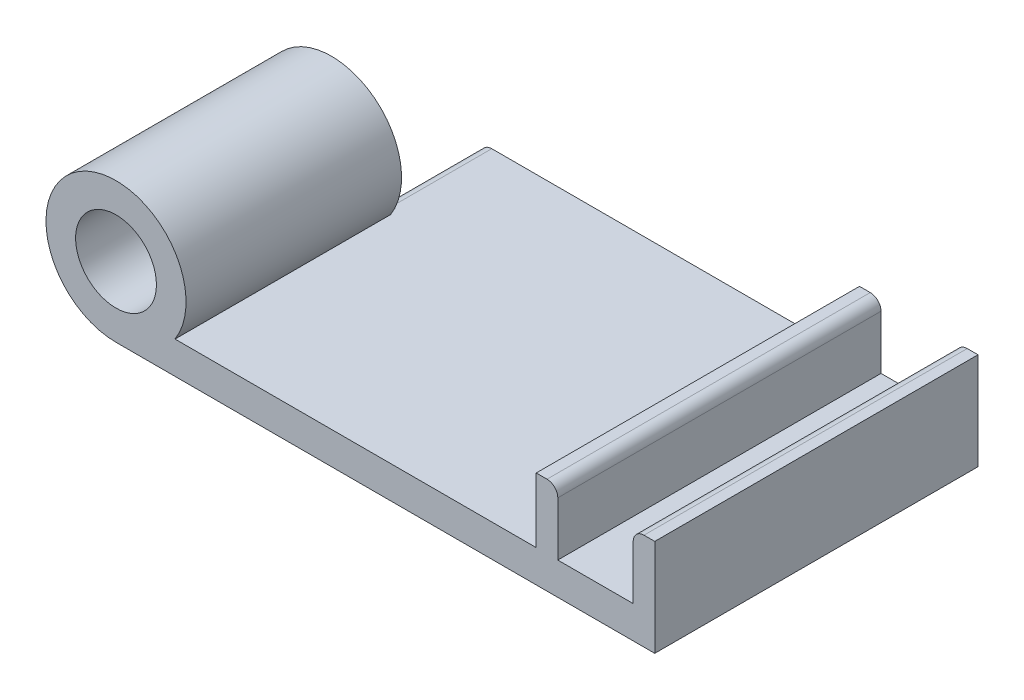
ISO-10303-21;
HEADER;
FILE_DESCRIPTION(('STEP AP214'),'2;1');
FILE_NAME('part.step','',(''),(''),'','','');
FILE_SCHEMA(('AUTOMOTIVE_DESIGN { 1 0 10303 214 1 1 1 1 }'));
ENDSEC;
DATA;
#1=APPLICATION_CONTEXT('core data for automotive mechanical design processes');
#2=APPLICATION_PROTOCOL_DEFINITION('international standard','automotive_design',2000,#1);
#3=PRODUCT_CONTEXT('',#1,'mechanical');
#4=PRODUCT('Part','Part','',(#3));
#5=PRODUCT_RELATED_PRODUCT_CATEGORY('part','',(#4));
#6=PRODUCT_DEFINITION_FORMATION('','',#4);
#7=PRODUCT_DEFINITION_CONTEXT('part definition',#1,'design');
#8=PRODUCT_DEFINITION('design','',#6,#7);
#9=PRODUCT_DEFINITION_SHAPE('','',#8);
#10=(LENGTH_UNIT() NAMED_UNIT(*) SI_UNIT(.MILLI.,.METRE.));
#11=(NAMED_UNIT(*) PLANE_ANGLE_UNIT() SI_UNIT($,.RADIAN.));
#12=(NAMED_UNIT(*) SI_UNIT($,.STERADIAN.) SOLID_ANGLE_UNIT());
#13=UNCERTAINTY_MEASURE_WITH_UNIT(LENGTH_MEASURE(1.E-05),#10,'distance_accuracy_value','');
#14=(GEOMETRIC_REPRESENTATION_CONTEXT(3) GLOBAL_UNCERTAINTY_ASSIGNED_CONTEXT((#13)) GLOBAL_UNIT_ASSIGNED_CONTEXT((#10,
#11,#12)) REPRESENTATION_CONTEXT('',''));
#15=CARTESIAN_POINT('',(0.,0.,0.));
#16=DIRECTION('',(0.,0.,1.));
#17=DIRECTION('',(1.,0.,0.));
#18=AXIS2_PLACEMENT_3D('',#15,#16,#17);
#19=CARTESIAN_POINT('',(-25.,-1.5,30.));
#20=DIRECTION('',(0.,1.,0.));
#21=DIRECTION('',(0.,0.,1.));
#22=AXIS2_PLACEMENT_3D('',#19,#20,#21);
#23=PLANE('',#22);
#24=DIRECTION('',(0.,0.,1.));
#25=VECTOR('',#24,1.);
#26=CARTESIAN_POINT('',(-21.1270166537926,-1.5,-10.));
#27=LINE('',#26,#25);
#28=CARTESIAN_POINT('',(-21.1270166537926,-1.5,0.));
#29=VERTEX_POINT('',#28);
#30=CARTESIAN_POINT('',(-21.1270166537926,-1.5,10.));
#31=VERTEX_POINT('',#30);
#32=EDGE_CURVE('E148',#29,#31,#27,.T.);
#33=ORIENTED_EDGE('',*,*,#32,.F.);
#34=DIRECTION('',(1.,0.,0.));
#35=VECTOR('',#34,1.);
#36=CARTESIAN_POINT('',(-25.,-1.5,0.));
#37=LINE('',#36,#35);
#38=CARTESIAN_POINT('',(25.,-1.5,0.));
#39=VERTEX_POINT('',#38);
#40=EDGE_CURVE('E218',#29,#39,#37,.T.);
#41=ORIENTED_EDGE('',*,*,#40,.T.);
#42=DIRECTION('',(0.,0.,-1.));
#43=VECTOR('',#42,1.);
#44=CARTESIAN_POINT('',(25.,-1.5,30.));
#45=LINE('',#44,#43);
#46=CARTESIAN_POINT('',(25.,-1.5,30.));
#47=VERTEX_POINT('',#46);
#48=EDGE_CURVE('E202',#47,#39,#45,.T.);
#49=ORIENTED_EDGE('',*,*,#48,.F.);
#50=DIRECTION('',(1.,0.,0.));
#51=VECTOR('',#50,1.);
#52=CARTESIAN_POINT('',(-25.,-1.5,30.));
#53=LINE('',#52,#51);
#54=CARTESIAN_POINT('',(-25.,-1.5,30.));
#55=VERTEX_POINT('',#54);
#56=EDGE_CURVE('E199',#55,#47,#53,.T.);
#57=ORIENTED_EDGE('',*,*,#56,.F.);
#58=DIRECTION('',(0.,0.,-1.));
#59=VECTOR('',#58,1.);
#60=CARTESIAN_POINT('',(-25.,-1.5,30.));
#61=LINE('',#60,#59);
#62=CARTESIAN_POINT('',(-25.,-1.5,10.));
#63=VERTEX_POINT('',#62);
#64=EDGE_CURVE('E157',#55,#63,#61,.T.);
#65=ORIENTED_EDGE('',*,*,#64,.T.);
#66=DIRECTION('',(-1.,0.,0.));
#67=VECTOR('',#66,1.);
#68=CARTESIAN_POINT('',(-21.1270166537926,-1.5,10.));
#69=LINE('',#68,#67);
#70=EDGE_CURVE('E141',#31,#63,#69,.T.);
#71=ORIENTED_EDGE('',*,*,#70,.F.);
#72=EDGE_LOOP('',(#33,#41,#49,#57,#65,#71));
#73=FACE_BOUND('',#72,.T.);
#74=ADVANCED_FACE('F33',(#73),#23,.F.);
#75=CARTESIAN_POINT('',(0.,0.,0.));
#76=DIRECTION('',(0.,0.,1.));
#77=DIRECTION('',(1.,0.,0.));
#78=AXIS2_PLACEMENT_3D('',#75,#76,#77);
#79=PLANE('',#78);
#80=DIRECTION('',(0.,-1.,0.));
#81=VECTOR('',#80,1.);
#82=CARTESIAN_POINT('',(23.,1.50000000000001,0.));
#83=LINE('',#82,#81);
#84=CARTESIAN_POINT('',(23.,6.50000000000001,0.));
#85=VERTEX_POINT('',#84);
#86=CARTESIAN_POINT('',(23.,1.50000000000001,0.));
#87=VERTEX_POINT('',#86);
#88=EDGE_CURVE('E205',#85,#87,#83,.T.);
#89=ORIENTED_EDGE('',*,*,#88,.F.);
#90=CARTESIAN_POINT('',(24.,6.50000000000001,0.));
#91=DIRECTION('',(0.,0.,1.));
#92=DIRECTION('',(1.,0.,0.));
#93=AXIS2_PLACEMENT_3D('',#90,#91,#92);
#94=CIRCLE('',#93,1.);
#95=CARTESIAN_POINT('',(24.,7.50000000000001,0.));
#96=VERTEX_POINT('',#95);
#97=EDGE_CURVE('E246',#85,#96,#94,.F.);
#98=ORIENTED_EDGE('',*,*,#97,.T.);
#99=DIRECTION('',(-1.,0.,0.));
#100=VECTOR('',#99,1.);
#101=CARTESIAN_POINT('',(25.,7.50000000000001,0.));
#102=LINE('',#101,#100);
#103=CARTESIAN_POINT('',(25.,7.50000000000001,0.));
#104=VERTEX_POINT('',#103);
#105=EDGE_CURVE('E177',#104,#96,#102,.T.);
#106=ORIENTED_EDGE('',*,*,#105,.F.);
#107=DIRECTION('',(0.,1.,0.));
#108=VECTOR('',#107,1.);
#109=CARTESIAN_POINT('',(25.,-1.5,0.));
#110=LINE('',#109,#108);
#111=EDGE_CURVE('E182',#39,#104,#110,.T.);
#112=ORIENTED_EDGE('',*,*,#111,.F.);
#113=ORIENTED_EDGE('',*,*,#40,.F.);
#114=DIRECTION('',(0.,-1.,0.));
#115=VECTOR('',#114,1.);
#116=CARTESIAN_POINT('',(-21.1270166537926,0.,0.));
#117=LINE('',#116,#115);
#118=CARTESIAN_POINT('',(-21.1270166537926,0.5,0.));
#119=VERTEX_POINT('',#118);
#120=EDGE_CURVE('E151',#119,#29,#117,.T.);
#121=ORIENTED_EDGE('',*,*,#120,.F.);
#122=CARTESIAN_POINT('',(-20.1270166537926,0.5,0.));
#123=DIRECTION('',(0.,0.,1.));
#124=DIRECTION('',(1.,0.,0.));
#125=AXIS2_PLACEMENT_3D('',#122,#123,#124);
#126=CIRCLE('',#125,1.);
#127=CARTESIAN_POINT('',(-20.1270166537926,1.5,0.));
#128=VERTEX_POINT('',#127);
#129=EDGE_CURVE('E242',#119,#128,#126,.F.);
#130=ORIENTED_EDGE('',*,*,#129,.T.);
#131=DIRECTION('',(-1.,0.,0.));
#132=VECTOR('',#131,1.);
#133=CARTESIAN_POINT('',(-21.1270166537926,1.5,0.));
#134=LINE('',#133,#132);
#135=CARTESIAN_POINT('',(14.,1.50000000000001,0.));
#136=VERTEX_POINT('',#135);
#137=EDGE_CURVE('E216',#136,#128,#134,.T.);
#138=ORIENTED_EDGE('',*,*,#137,.F.);
#139=DIRECTION('',(0.,-1.,0.));
#140=VECTOR('',#139,1.);
#141=CARTESIAN_POINT('',(14.,7.50000000000001,0.));
#142=LINE('',#141,#140);
#143=CARTESIAN_POINT('',(14.,7.50000000000001,0.));
#144=VERTEX_POINT('',#143);
#145=EDGE_CURVE('E214',#144,#136,#142,.T.);
#146=ORIENTED_EDGE('',*,*,#145,.F.);
#147=DIRECTION('',(-1.,0.,0.));
#148=VECTOR('',#147,1.);
#149=CARTESIAN_POINT('',(16.,7.50000000000001,0.));
#150=LINE('',#149,#148);
#151=CARTESIAN_POINT('',(15.,7.50000000000001,0.));
#152=VERTEX_POINT('',#151);
#153=EDGE_CURVE('E212',#152,#144,#150,.T.);
#154=ORIENTED_EDGE('',*,*,#153,.F.);
#155=CARTESIAN_POINT('',(15.,6.50000000000001,0.));
#156=DIRECTION('',(0.,0.,1.));
#157=DIRECTION('',(1.,0.,0.));
#158=AXIS2_PLACEMENT_3D('',#155,#156,#157);
#159=CIRCLE('',#158,1.);
#160=CARTESIAN_POINT('',(16.,6.50000000000001,0.));
#161=VERTEX_POINT('',#160);
#162=EDGE_CURVE('E244',#152,#161,#159,.F.);
#163=ORIENTED_EDGE('',*,*,#162,.T.);
#164=DIRECTION('',(0.,1.,0.));
#165=VECTOR('',#164,1.);
#166=CARTESIAN_POINT('',(16.,7.50000000000001,0.));
#167=LINE('',#166,#165);
#168=CARTESIAN_POINT('',(16.,1.50000000000001,0.));
#169=VERTEX_POINT('',#168);
#170=EDGE_CURVE('E209',#169,#161,#167,.T.);
#171=ORIENTED_EDGE('',*,*,#170,.F.);
#172=DIRECTION('',(-1.,0.,0.));
#173=VECTOR('',#172,1.);
#174=CARTESIAN_POINT('',(16.,1.50000000000001,0.));
#175=LINE('',#174,#173);
#176=EDGE_CURVE('E207',#87,#169,#175,.T.);
#177=ORIENTED_EDGE('',*,*,#176,.F.);
#178=EDGE_LOOP('',(#89,#98,#106,#112,#113,#121,#130,#138,#146,#154,#163,#171,#177));
#179=FACE_BOUND('',#178,.T.);
#180=ADVANCED_FACE('F263',(#179),#79,.F.);
#181=CARTESIAN_POINT('',(25.,7.50000000000001,30.));
#182=DIRECTION('',(0.,-1.,0.));
#183=DIRECTION('',(0.,0.,-1.));
#184=AXIS2_PLACEMENT_3D('',#181,#182,#183);
#185=PLANE('',#184);
#186=ORIENTED_EDGE('',*,*,#105,.T.);
#187=DIRECTION('',(0.,0.,-1.));
#188=VECTOR('',#187,1.);
#189=CARTESIAN_POINT('',(24.,7.50000000000001,30.));
#190=LINE('',#189,#188);
#191=CARTESIAN_POINT('',(24.,7.50000000000001,30.));
#192=VERTEX_POINT('',#191);
#193=EDGE_CURVE('E248',#96,#192,#190,.F.);
#194=ORIENTED_EDGE('',*,*,#193,.T.);
#195=DIRECTION('',(-1.,0.,0.));
#196=VECTOR('',#195,1.);
#197=CARTESIAN_POINT('',(25.,7.50000000000001,30.));
#198=LINE('',#197,#196);
#199=CARTESIAN_POINT('',(25.,7.50000000000001,30.));
#200=VERTEX_POINT('',#199);
#201=EDGE_CURVE('E181',#200,#192,#198,.T.);
#202=ORIENTED_EDGE('',*,*,#201,.F.);
#203=DIRECTION('',(0.,0.,-1.));
#204=VECTOR('',#203,1.);
#205=CARTESIAN_POINT('',(25.,7.50000000000001,30.));
#206=LINE('',#205,#204);
#207=EDGE_CURVE('E236',#200,#104,#206,.T.);
#208=ORIENTED_EDGE('',*,*,#207,.T.);
#209=EDGE_LOOP('',(#186,#194,#202,#208));
#210=FACE_BOUND('',#209,.T.);
#211=ADVANCED_FACE('F290',(#210),#185,.F.);
#212=CARTESIAN_POINT('',(23.,1.50000000000001,30.));
#213=DIRECTION('',(1.,0.,0.));
#214=DIRECTION('',(0.,0.,-1.));
#215=AXIS2_PLACEMENT_3D('',#212,#213,#214);
#216=PLANE('',#215);
#217=DIRECTION('',(0.,-1.,0.));
#218=VECTOR('',#217,1.);
#219=CARTESIAN_POINT('',(23.,1.50000000000001,30.));
#220=LINE('',#219,#218);
#221=CARTESIAN_POINT('',(23.,6.50000000000001,30.));
#222=VERTEX_POINT('',#221);
#223=CARTESIAN_POINT('',(23.,1.50000000000001,30.));
#224=VERTEX_POINT('',#223);
#225=EDGE_CURVE('E185',#222,#224,#220,.T.);
#226=ORIENTED_EDGE('',*,*,#225,.F.);
#227=DIRECTION('',(0.,0.,-1.));
#228=VECTOR('',#227,1.);
#229=CARTESIAN_POINT('',(23.,6.50000000000001,30.));
#230=LINE('',#229,#228);
#231=EDGE_CURVE('E239',#222,#85,#230,.T.);
#232=ORIENTED_EDGE('',*,*,#231,.T.);
#233=ORIENTED_EDGE('',*,*,#88,.T.);
#234=DIRECTION('',(0.,0.,-1.));
#235=VECTOR('',#234,1.);
#236=CARTESIAN_POINT('',(23.,1.50000000000001,30.));
#237=LINE('',#236,#235);
#238=EDGE_CURVE('E233',#224,#87,#237,.T.);
#239=ORIENTED_EDGE('',*,*,#238,.F.);
#240=EDGE_LOOP('',(#226,#232,#233,#239));
#241=FACE_BOUND('',#240,.T.);
#242=ADVANCED_FACE('F311',(#241),#216,.F.);
#243=CARTESIAN_POINT('',(16.,1.50000000000001,30.));
#244=DIRECTION('',(0.,-1.,0.));
#245=DIRECTION('',(1.,0.,0.));
#246=AXIS2_PLACEMENT_3D('',#243,#244,#245);
#247=PLANE('',#246);
#248=ORIENTED_EDGE('',*,*,#176,.T.);
#249=DIRECTION('',(0.,0.,-1.));
#250=VECTOR('',#249,1.);
#251=CARTESIAN_POINT('',(16.,1.50000000000001,30.));
#252=LINE('',#251,#250);
#253=CARTESIAN_POINT('',(16.,1.50000000000001,30.));
#254=VERTEX_POINT('',#253);
#255=EDGE_CURVE('E230',#254,#169,#252,.T.);
#256=ORIENTED_EDGE('',*,*,#255,.F.);
#257=DIRECTION('',(-1.,0.,0.));
#258=VECTOR('',#257,1.);
#259=CARTESIAN_POINT('',(16.,1.50000000000001,30.));
#260=LINE('',#259,#258);
#261=EDGE_CURVE('E187',#224,#254,#260,.T.);
#262=ORIENTED_EDGE('',*,*,#261,.F.);
#263=ORIENTED_EDGE('',*,*,#238,.T.);
#264=EDGE_LOOP('',(#248,#256,#262,#263));
#265=FACE_BOUND('',#264,.T.);
#266=ADVANCED_FACE('F307',(#265),#247,.F.);
#267=CARTESIAN_POINT('',(16.,7.50000000000001,30.));
#268=DIRECTION('',(-1.,0.,0.));
#269=DIRECTION('',(0.,0.,1.));
#270=AXIS2_PLACEMENT_3D('',#267,#268,#269);
#271=PLANE('',#270);
#272=ORIENTED_EDGE('',*,*,#170,.T.);
#273=DIRECTION('',(0.,0.,-1.));
#274=VECTOR('',#273,1.);
#275=CARTESIAN_POINT('',(16.,6.50000000000001,30.));
#276=LINE('',#275,#274);
#277=CARTESIAN_POINT('',(16.,6.50000000000001,30.));
#278=VERTEX_POINT('',#277);
#279=EDGE_CURVE('E257',#161,#278,#276,.F.);
#280=ORIENTED_EDGE('',*,*,#279,.T.);
#281=DIRECTION('',(0.,1.,0.));
#282=VECTOR('',#281,1.);
#283=CARTESIAN_POINT('',(16.,7.50000000000001,30.));
#284=LINE('',#283,#282);
#285=EDGE_CURVE('E189',#254,#278,#284,.T.);
#286=ORIENTED_EDGE('',*,*,#285,.F.);
#287=ORIENTED_EDGE('',*,*,#255,.T.);
#288=EDGE_LOOP('',(#272,#280,#286,#287));
#289=FACE_BOUND('',#288,.T.);
#290=ADVANCED_FACE('F303',(#289),#271,.F.);
#291=CARTESIAN_POINT('',(16.,7.50000000000001,30.));
#292=DIRECTION('',(0.,-1.,0.));
#293=DIRECTION('',(1.,0.,0.));
#294=AXIS2_PLACEMENT_3D('',#291,#292,#293);
#295=PLANE('',#294);
#296=DIRECTION('',(-1.,0.,0.));
#297=VECTOR('',#296,1.);
#298=CARTESIAN_POINT('',(16.,7.50000000000001,30.));
#299=LINE('',#298,#297);
#300=CARTESIAN_POINT('',(15.,7.50000000000001,30.));
#301=VERTEX_POINT('',#300);
#302=CARTESIAN_POINT('',(14.,7.50000000000001,30.));
#303=VERTEX_POINT('',#302);
#304=EDGE_CURVE('E192',#301,#303,#299,.T.);
#305=ORIENTED_EDGE('',*,*,#304,.F.);
#306=DIRECTION('',(0.,0.,-1.));
#307=VECTOR('',#306,1.);
#308=CARTESIAN_POINT('',(15.,7.50000000000001,30.));
#309=LINE('',#308,#307);
#310=EDGE_CURVE('E254',#301,#152,#309,.T.);
#311=ORIENTED_EDGE('',*,*,#310,.T.);
#312=ORIENTED_EDGE('',*,*,#153,.T.);
#313=DIRECTION('',(0.,0.,-1.));
#314=VECTOR('',#313,1.);
#315=CARTESIAN_POINT('',(14.,7.50000000000001,30.));
#316=LINE('',#315,#314);
#317=EDGE_CURVE('E227',#303,#144,#316,.T.);
#318=ORIENTED_EDGE('',*,*,#317,.F.);
#319=EDGE_LOOP('',(#305,#311,#312,#318));
#320=FACE_BOUND('',#319,.T.);
#321=ADVANCED_FACE('F299',(#320),#295,.F.);
#322=CARTESIAN_POINT('',(14.,7.50000000000001,30.));
#323=DIRECTION('',(1.,0.,0.));
#324=DIRECTION('',(0.,1.,0.));
#325=AXIS2_PLACEMENT_3D('',#322,#323,#324);
#326=PLANE('',#325);
#327=ORIENTED_EDGE('',*,*,#145,.T.);
#328=DIRECTION('',(0.,0.,-1.));
#329=VECTOR('',#328,1.);
#330=CARTESIAN_POINT('',(14.,1.50000000000001,30.));
#331=LINE('',#330,#329);
#332=CARTESIAN_POINT('',(14.,1.50000000000001,30.));
#333=VERTEX_POINT('',#332);
#334=EDGE_CURVE('E224',#333,#136,#331,.T.);
#335=ORIENTED_EDGE('',*,*,#334,.F.);
#336=DIRECTION('',(0.,-1.,0.));
#337=VECTOR('',#336,1.);
#338=CARTESIAN_POINT('',(14.,7.50000000000001,30.));
#339=LINE('',#338,#337);
#340=EDGE_CURVE('E194',#303,#333,#339,.T.);
#341=ORIENTED_EDGE('',*,*,#340,.F.);
#342=ORIENTED_EDGE('',*,*,#317,.T.);
#343=EDGE_LOOP('',(#327,#335,#341,#342));
#344=FACE_BOUND('',#343,.T.);
#345=ADVANCED_FACE('F296',(#344),#326,.F.);
#346=CARTESIAN_POINT('',(-21.1270166537926,1.5,30.));
#347=DIRECTION('',(0.,-1.,0.));
#348=DIRECTION('',(1.,0.,0.));
#349=AXIS2_PLACEMENT_3D('',#346,#347,#348);
#350=PLANE('',#349);
#351=ORIENTED_EDGE('',*,*,#137,.T.);
#352=DIRECTION('',(0.,0.,-1.));
#353=VECTOR('',#352,1.);
#354=CARTESIAN_POINT('',(-20.1270166537926,1.5,10.));
#355=LINE('',#354,#353);
#356=CARTESIAN_POINT('',(-20.1270166537926,1.5,10.));
#357=VERTEX_POINT('',#356);
#358=EDGE_CURVE('E41',#128,#357,#355,.F.);
#359=ORIENTED_EDGE('',*,*,#358,.T.);
#360=DIRECTION('',(-1.,0.,0.));
#361=VECTOR('',#360,1.);
#362=CARTESIAN_POINT('',(-21.1270166537926,1.5,10.));
#363=LINE('',#362,#361);
#364=CARTESIAN_POINT('',(-19.5227744249483,1.5,10.));
#365=VERTEX_POINT('',#364);
#366=EDGE_CURVE('E175',#365,#357,#363,.T.);
#367=ORIENTED_EDGE('',*,*,#366,.F.);
#368=DIRECTION('',(0.,0.,1.));
#369=VECTOR('',#368,1.);
#370=CARTESIAN_POINT('',(-19.5227744249483,1.5,10.));
#371=LINE('',#370,#369);
#372=CARTESIAN_POINT('',(-19.5227744249483,1.5,30.));
#373=VERTEX_POINT('',#372);
#374=EDGE_CURVE('E170',#365,#373,#371,.T.);
#375=ORIENTED_EDGE('',*,*,#374,.T.);
#376=DIRECTION('',(-1.,0.,0.));
#377=VECTOR('',#376,1.);
#378=CARTESIAN_POINT('',(-21.1270166537926,1.5,30.));
#379=LINE('',#378,#377);
#380=EDGE_CURVE('E196',#333,#373,#379,.T.);
#381=ORIENTED_EDGE('',*,*,#380,.F.);
#382=ORIENTED_EDGE('',*,*,#334,.T.);
#383=EDGE_LOOP('',(#351,#359,#367,#375,#381,#382));
#384=FACE_BOUND('',#383,.T.);
#385=ADVANCED_FACE('F277',(#384),#350,.F.);
#386=CARTESIAN_POINT('',(25.,-1.5,30.));
#387=DIRECTION('',(-1.,0.,0.));
#388=DIRECTION('',(0.,0.,1.));
#389=AXIS2_PLACEMENT_3D('',#386,#387,#388);
#390=PLANE('',#389);
#391=ORIENTED_EDGE('',*,*,#111,.T.);
#392=ORIENTED_EDGE('',*,*,#207,.F.);
#393=DIRECTION('',(0.,1.,0.));
#394=VECTOR('',#393,1.);
#395=CARTESIAN_POINT('',(25.,1.5,30.));
#396=LINE('',#395,#394);
#397=EDGE_CURVE('E178',#47,#200,#396,.T.);
#398=ORIENTED_EDGE('',*,*,#397,.F.);
#399=ORIENTED_EDGE('',*,*,#48,.T.);
#400=EDGE_LOOP('',(#391,#392,#398,#399));
#401=FACE_BOUND('',#400,.T.);
#402=ADVANCED_FACE('F269',(#401),#390,.F.);
#403=CARTESIAN_POINT('',(0.,0.,30.));
#404=DIRECTION('',(0.,0.,1.));
#405=DIRECTION('',(1.,0.,0.));
#406=AXIS2_PLACEMENT_3D('',#403,#404,#405);
#407=PLANE('',#406);
#408=ORIENTED_EDGE('',*,*,#201,.T.);
#409=CARTESIAN_POINT('',(24.,6.50000000000001,30.));
#410=DIRECTION('',(0.,0.,1.));
#411=DIRECTION('',(1.,0.,0.));
#412=AXIS2_PLACEMENT_3D('',#409,#410,#411);
#413=CIRCLE('',#412,1.);
#414=EDGE_CURVE('E252',#192,#222,#413,.T.);
#415=ORIENTED_EDGE('',*,*,#414,.T.);
#416=ORIENTED_EDGE('',*,*,#225,.T.);
#417=ORIENTED_EDGE('',*,*,#261,.T.);
#418=ORIENTED_EDGE('',*,*,#285,.T.);
#419=CARTESIAN_POINT('',(15.,6.50000000000001,30.));
#420=DIRECTION('',(0.,0.,1.));
#421=DIRECTION('',(1.,0.,0.));
#422=AXIS2_PLACEMENT_3D('',#419,#420,#421);
#423=CIRCLE('',#422,1.);
#424=EDGE_CURVE('E250',#278,#301,#423,.T.);
#425=ORIENTED_EDGE('',*,*,#424,.T.);
#426=ORIENTED_EDGE('',*,*,#304,.T.);
#427=ORIENTED_EDGE('',*,*,#340,.T.);
#428=ORIENTED_EDGE('',*,*,#380,.T.);
#429=CARTESIAN_POINT('',(-25.,5.,30.));
#430=DIRECTION('',(0.,0.,1.));
#431=DIRECTION('',(1.,0.,0.));
#432=AXIS2_PLACEMENT_3D('',#429,#430,#431);
#433=CIRCLE('',#432,6.5);
#434=EDGE_CURVE('E165',#373,#55,#433,.T.);
#435=ORIENTED_EDGE('',*,*,#434,.T.);
#436=ORIENTED_EDGE('',*,*,#56,.T.);
#437=ORIENTED_EDGE('',*,*,#397,.T.);
#438=EDGE_LOOP('',(#408,#415,#416,#417,#418,#425,#426,#427,#428,#435,#436,#437));
#439=FACE_BOUND('',#438,.T.);
#440=CARTESIAN_POINT('',(-25.,5.,30.));
#441=DIRECTION('',(0.,0.,1.));
#442=DIRECTION('',(1.,0.,0.));
#443=AXIS2_PLACEMENT_3D('',#440,#441,#442);
#444=CIRCLE('',#443,3.75);
#445=CARTESIAN_POINT('',(-21.25,5.,30.));
#446=VERTEX_POINT('',#445);
#447=EDGE_CURVE('E161',#446,#446,#444,.T.);
#448=ORIENTED_EDGE('',*,*,#447,.F.);
#449=EDGE_LOOP('',(#448));
#450=FACE_BOUND('',#449,.T.);
#451=ADVANCED_FACE('F272',(#439,#450),#407,.T.);
#452=CARTESIAN_POINT('',(-25.,5.,10.));
#453=DIRECTION('',(0.,0.,1.));
#454=DIRECTION('',(1.,0.,0.));
#455=AXIS2_PLACEMENT_3D('',#452,#453,#454);
#456=PLANE('',#455);
#457=CARTESIAN_POINT('',(-25.,5.,10.));
#458=DIRECTION('',(0.,0.,1.));
#459=DIRECTION('',(1.,0.,0.));
#460=AXIS2_PLACEMENT_3D('',#457,#458,#459);
#461=CIRCLE('',#460,3.75);
#462=CARTESIAN_POINT('',(-21.25,5.,10.));
#463=VERTEX_POINT('',#462);
#464=EDGE_CURVE('E162',#463,#463,#461,.T.);
#465=ORIENTED_EDGE('',*,*,#464,.T.);
#466=EDGE_LOOP('',(#465));
#467=FACE_BOUND('',#466,.T.);
#468=ORIENTED_EDGE('',*,*,#366,.T.);
#469=CARTESIAN_POINT('',(-20.1270166537926,0.5,10.));
#470=DIRECTION('',(0.,0.,1.));
#471=DIRECTION('',(1.,0.,0.));
#472=AXIS2_PLACEMENT_3D('',#469,#470,#471);
#473=CIRCLE('',#472,1.);
#474=CARTESIAN_POINT('',(-21.1270166537926,0.5,10.));
#475=VERTEX_POINT('',#474);
#476=EDGE_CURVE('E11',#357,#475,#473,.T.);
#477=ORIENTED_EDGE('',*,*,#476,.T.);
#478=DIRECTION('',(0.,-1.,0.));
#479=VECTOR('',#478,1.);
#480=CARTESIAN_POINT('',(-21.1270166537926,1.5,10.));
#481=LINE('',#480,#479);
#482=EDGE_CURVE('E136',#475,#31,#481,.T.);
#483=ORIENTED_EDGE('',*,*,#482,.T.);
#484=ORIENTED_EDGE('',*,*,#70,.T.);
#485=CARTESIAN_POINT('',(-25.,5.,10.));
#486=DIRECTION('',(0.,0.,1.));
#487=DIRECTION('',(1.,0.,0.));
#488=AXIS2_PLACEMENT_3D('',#485,#486,#487);
#489=CIRCLE('',#488,6.5);
#490=EDGE_CURVE('E168',#365,#63,#489,.T.);
#491=ORIENTED_EDGE('',*,*,#490,.F.);
#492=EDGE_LOOP('',(#468,#477,#483,#484,#491));
#493=FACE_BOUND('',#492,.T.);
#494=ADVANCED_FACE('F138',(#467,#493),#456,.F.);
#495=CARTESIAN_POINT('',(-25.,5.,10.));
#496=DIRECTION('',(0.,0.,1.));
#497=DIRECTION('',(1.,0.,0.));
#498=AXIS2_PLACEMENT_3D('',#495,#496,#497);
#499=CYLINDRICAL_SURFACE('',#498,6.5);
#500=ORIENTED_EDGE('',*,*,#374,.F.);
#501=ORIENTED_EDGE('',*,*,#490,.T.);
#502=ORIENTED_EDGE('',*,*,#64,.F.);
#503=ORIENTED_EDGE('',*,*,#434,.F.);
#504=EDGE_LOOP('',(#500,#501,#502,#503));
#505=FACE_BOUND('',#504,.T.);
#506=ADVANCED_FACE('F276',(#505),#499,.T.);
#507=CARTESIAN_POINT('',(-25.,5.,10.));
#508=DIRECTION('',(0.,0.,1.));
#509=DIRECTION('',(1.,0.,0.));
#510=AXIS2_PLACEMENT_3D('',#507,#508,#509);
#511=CYLINDRICAL_SURFACE('',#510,3.75);
#512=ORIENTED_EDGE('',*,*,#464,.F.);
#513=EDGE_LOOP('',(#512));
#514=FACE_BOUND('',#513,.T.);
#515=ORIENTED_EDGE('',*,*,#447,.T.);
#516=EDGE_LOOP('',(#515));
#517=FACE_BOUND('',#516,.T.);
#518=ADVANCED_FACE('F324',(#514,#517),#511,.F.);
#519=CARTESIAN_POINT('',(-21.1270166537926,1.5,-10.));
#520=DIRECTION('',(-1.,0.,0.));
#521=DIRECTION('',(0.,0.,1.));
#522=AXIS2_PLACEMENT_3D('',#519,#520,#521);
#523=PLANE('',#522);
#524=ORIENTED_EDGE('',*,*,#482,.F.);
#525=DIRECTION('',(0.,0.,-1.));
#526=VECTOR('',#525,1.);
#527=CARTESIAN_POINT('',(-21.1270166537926,0.5,0.));
#528=LINE('',#527,#526);
#529=EDGE_CURVE('E259',#475,#119,#528,.T.);
#530=ORIENTED_EDGE('',*,*,#529,.T.);
#531=ORIENTED_EDGE('',*,*,#120,.T.);
#532=ORIENTED_EDGE('',*,*,#32,.T.);
#533=EDGE_LOOP('',(#524,#530,#531,#532));
#534=FACE_BOUND('',#533,.T.);
#535=ADVANCED_FACE('F149',(#534),#523,.T.);
#536=CARTESIAN_POINT('',(24.,6.50000000000001,30.));
#537=DIRECTION('',(0.,0.,-1.));
#538=DIRECTION('',(-1.,0.,0.));
#539=AXIS2_PLACEMENT_3D('',#536,#537,#538);
#540=CYLINDRICAL_SURFACE('',#539,1.);
#541=ORIENTED_EDGE('',*,*,#414,.F.);
#542=ORIENTED_EDGE('',*,*,#193,.F.);
#543=ORIENTED_EDGE('',*,*,#97,.F.);
#544=ORIENTED_EDGE('',*,*,#231,.F.);
#545=EDGE_LOOP('',(#541,#542,#543,#544));
#546=FACE_BOUND('',#545,.T.);
#547=ADVANCED_FACE('F283',(#546),#540,.T.);
#548=CARTESIAN_POINT('',(15.,6.50000000000001,30.));
#549=DIRECTION('',(0.,0.,-1.));
#550=DIRECTION('',(-1.,0.,0.));
#551=AXIS2_PLACEMENT_3D('',#548,#549,#550);
#552=CYLINDRICAL_SURFACE('',#551,1.);
#553=ORIENTED_EDGE('',*,*,#424,.F.);
#554=ORIENTED_EDGE('',*,*,#279,.F.);
#555=ORIENTED_EDGE('',*,*,#162,.F.);
#556=ORIENTED_EDGE('',*,*,#310,.F.);
#557=EDGE_LOOP('',(#553,#554,#555,#556));
#558=FACE_BOUND('',#557,.T.);
#559=ADVANCED_FACE('F279',(#558),#552,.T.);
#560=CARTESIAN_POINT('',(-20.1270166537926,0.5,-10.));
#561=DIRECTION('',(0.,0.,1.));
#562=DIRECTION('',(1.,0.,0.));
#563=AXIS2_PLACEMENT_3D('',#560,#561,#562);
#564=CYLINDRICAL_SURFACE('',#563,1.);
#565=ORIENTED_EDGE('',*,*,#476,.F.);
#566=ORIENTED_EDGE('',*,*,#358,.F.);
#567=ORIENTED_EDGE('',*,*,#129,.F.);
#568=ORIENTED_EDGE('',*,*,#529,.F.);
#569=EDGE_LOOP('',(#565,#566,#567,#568));
#570=FACE_BOUND('',#569,.T.);
#571=ADVANCED_FACE('F35',(#570),#564,.T.);
#572=CLOSED_SHELL('',(#74,#180,#211,#242,#266,#290,#321,#345,#385,#402,#451,#494,#506,#518,#535,
#547,#559,#571));
#573=MANIFOLD_SOLID_BREP('B2',#572);
#574=ADVANCED_BREP_SHAPE_REPRESENTATION('',(#18,#573),#14);
#575=SHAPE_DEFINITION_REPRESENTATION(#9,#574);
ENDSEC;
END-ISO-10303-21;
